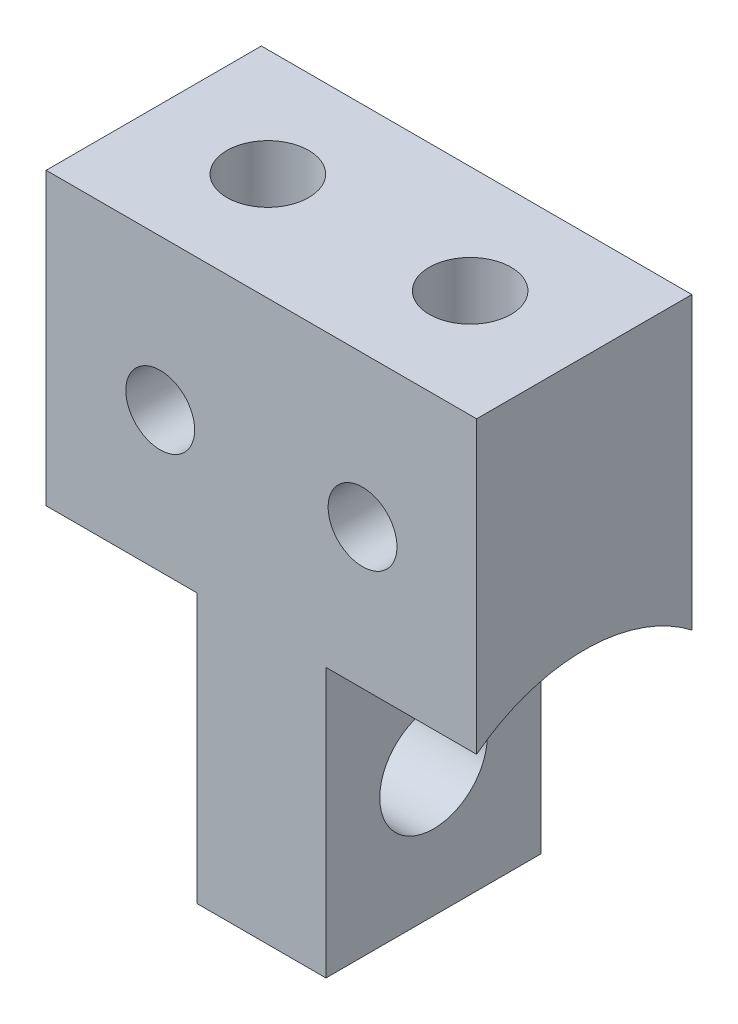
ISO-10303-21;
HEADER;
FILE_DESCRIPTION(('STEP AP214'),'2;1');
FILE_NAME('part.step','',(''),(''),'','','');
FILE_SCHEMA(('AUTOMOTIVE_DESIGN { 1 0 10303 214 1 1 1 1 }'));
ENDSEC;
DATA;
#1=APPLICATION_CONTEXT('core data for automotive mechanical design processes');
#2=APPLICATION_PROTOCOL_DEFINITION('international standard','automotive_design',2000,#1);
#3=PRODUCT_CONTEXT('',#1,'mechanical');
#4=PRODUCT('Part','Part','',(#3));
#5=PRODUCT_RELATED_PRODUCT_CATEGORY('part','',(#4));
#6=PRODUCT_DEFINITION_FORMATION('','',#4);
#7=PRODUCT_DEFINITION_CONTEXT('part definition',#1,'design');
#8=PRODUCT_DEFINITION('design','',#6,#7);
#9=PRODUCT_DEFINITION_SHAPE('','',#8);
#10=(LENGTH_UNIT() NAMED_UNIT(*) SI_UNIT(.MILLI.,.METRE.));
#11=(NAMED_UNIT(*) PLANE_ANGLE_UNIT() SI_UNIT($,.RADIAN.));
#12=(NAMED_UNIT(*) SI_UNIT($,.STERADIAN.) SOLID_ANGLE_UNIT());
#13=UNCERTAINTY_MEASURE_WITH_UNIT(LENGTH_MEASURE(1.E-05),#10,'distance_accuracy_value','');
#14=(GEOMETRIC_REPRESENTATION_CONTEXT(3) GLOBAL_UNCERTAINTY_ASSIGNED_CONTEXT((#13)) GLOBAL_UNIT_ASSIGNED_CONTEXT((#10,
#11,#12)) REPRESENTATION_CONTEXT('',''));
#15=CARTESIAN_POINT('',(0.,0.,0.));
#16=DIRECTION('',(0.,0.,1.));
#17=DIRECTION('',(1.,0.,0.));
#18=AXIS2_PLACEMENT_3D('',#15,#16,#17);
#19=CARTESIAN_POINT('',(-2.35,3.,5.));
#20=DIRECTION('',(0.,0.,-1.));
#21=DIRECTION('',(-1.,0.,0.));
#22=AXIS2_PLACEMENT_3D('',#19,#20,#21);
#23=CYLINDRICAL_SURFACE('',#22,0.8);
#24=CARTESIAN_POINT('',(-2.35,3.,5.));
#25=DIRECTION('',(0.,0.,1.));
#26=DIRECTION('',(1.,0.,0.));
#27=AXIS2_PLACEMENT_3D('',#24,#25,#26);
#28=CIRCLE('',#27,0.8);
#29=CARTESIAN_POINT('',(-1.55,3.,5.));
#30=VERTEX_POINT('',#29);
#31=EDGE_CURVE('E311',#30,#30,#28,.T.);
#32=ORIENTED_EDGE('',*,*,#31,.T.);
#33=EDGE_LOOP('',(#32));
#34=FACE_BOUND('',#33,.T.);
#35=CARTESIAN_POINT('',(-2.35,3.,0.));
#36=DIRECTION('',(0.,0.,1.));
#37=DIRECTION('',(1.,0.,0.));
#38=AXIS2_PLACEMENT_3D('',#35,#36,#37);
#39=CIRCLE('',#38,0.8);
#40=CARTESIAN_POINT('',(-1.55,3.,0.));
#41=VERTEX_POINT('',#40);
#42=EDGE_CURVE('E308',#41,#41,#39,.T.);
#43=ORIENTED_EDGE('',*,*,#42,.F.);
#44=EDGE_LOOP('',(#43));
#45=FACE_BOUND('',#44,.T.);
#46=CARTESIAN_POINT('',(-1.72550020016016,3.5,3.21589105316382));
#47=CARTESIAN_POINT('',(-1.75301055320319,3.53431435195809,3.23993184582808));
#48=CARTESIAN_POINT('',(-1.78353100918924,3.56666598593497,3.26371468114399));
#49=CARTESIAN_POINT('',(-1.85071395402182,3.62671853094582,3.30923352889173));
#50=CARTESIAN_POINT('',(-1.88742589891339,3.65437807795749,3.33095066272691));
#51=CARTESIAN_POINT('',(-1.95869479972963,3.69875943218527,3.36639071111825));
#52=CARTESIAN_POINT('',(-1.99220492473001,3.71656229625455,3.38084325634963));
#53=CARTESIAN_POINT('',(-2.06245944293185,3.74752169735336,3.40620513563468));
#54=CARTESIAN_POINT('',(-2.09919364664926,3.76069225753749,3.41712515533806));
#55=CARTESIAN_POINT('',(-2.17553630067847,3.78175562211247,3.43467004602641));
#56=CARTESIAN_POINT('',(-2.21516770677243,3.78959970272312,3.44125524814546));
#57=CARTESIAN_POINT('',(-2.29569576113832,3.79918202346721,3.44930746544825));
#58=CARTESIAN_POINT('',(-2.33659227342639,3.80092091755081,3.45077502880195));
#59=CARTESIAN_POINT('',(-2.41259358055849,3.79833165295423,3.44859555518797));
#60=CARTESIAN_POINT('',(-2.44774785061444,3.79477678136385,3.44560037974004));
#61=CARTESIAN_POINT('',(-2.5167550120299,3.78320871800817,3.43589855359897));
#62=CARTESIAN_POINT('',(-2.55060858744674,3.77519790498292,3.42919388317638));
#63=CARTESIAN_POINT('',(-2.61648948201297,3.75510255006901,3.41249541575778));
#64=CARTESIAN_POINT('',(-2.64850173058375,3.74298880799513,3.40247805506654));
#65=CARTESIAN_POINT('',(-2.7100053262118,3.71521846927709,3.37975887461044));
#66=CARTESIAN_POINT('',(-2.73949019772671,3.69955312600749,3.36705043263298));
#67=CARTESIAN_POINT('',(-2.80827303658835,3.65747385956863,3.33338875386016));
#68=CARTESIAN_POINT('',(-2.84599374919368,3.62939982473765,3.31130311992539));
#69=CARTESIAN_POINT('',(-2.91501020161723,3.56821065625755,3.26485374494461));
#70=CARTESIAN_POINT('',(-2.94634303187075,3.53512668852513,3.2405044244332));
#71=CARTESIAN_POINT('',(-2.97449979983984,3.5,3.21589105316381));
#72=B_SPLINE_CURVE_WITH_KNOTS('',3,(#46,#47,#48,#49,#50,#51,#52,#53,#54,#55,#56,#57,#58,#59,#60,
#61,#62,#63,#64,#65,#66,#67,#68,#69,#70,#71),.UNSPECIFIED.,.F.,.F.,(4,2,2,2,2,2,2,2,2,2,2,2,4),
(0.,0.150540881245239,0.302346746946312,0.423678394160233,0.544639512769526,0.666692728387725,
0.788732870015016,0.894604193645644,1.00041905356436,1.10700338996258,1.21385312209222,
1.36892840745185,1.52307587518184),.UNSPECIFIED.);
#73=CARTESIAN_POINT('',(-1.72550020016016,3.5,3.21589105316382));
#74=VERTEX_POINT('',#73);
#75=CARTESIAN_POINT('',(-2.97449979983984,3.5,3.21589105316381));
#76=VERTEX_POINT('',#75);
#77=EDGE_CURVE('E178',#74,#76,#72,.T.);
#78=ORIENTED_EDGE('',*,*,#77,.F.);
#79=DIRECTION('',(0.,0.,-1.));
#80=VECTOR('',#79,1.);
#81=CARTESIAN_POINT('',(-1.72550020016016,3.5,5.));
#82=LINE('',#81,#80);
#83=CARTESIAN_POINT('',(-1.72550020016016,3.5,1.78410894683618));
#84=VERTEX_POINT('',#83);
#85=EDGE_CURVE('E139',#74,#84,#82,.T.);
#86=ORIENTED_EDGE('',*,*,#85,.T.);
#87=CARTESIAN_POINT('',(-2.97449979983984,3.5,1.78410894683618));
#88=CARTESIAN_POINT('',(-2.9469894467968,3.53431435195809,1.76006815417192));
#89=CARTESIAN_POINT('',(-2.91646899081076,3.56666598593497,1.73628531885601));
#90=CARTESIAN_POINT('',(-2.84928604597818,3.62671853094582,1.69076647110827));
#91=CARTESIAN_POINT('',(-2.81257410108661,3.65437807795749,1.66904933727309));
#92=CARTESIAN_POINT('',(-2.74130520027036,3.69875943218528,1.63360928888175));
#93=CARTESIAN_POINT('',(-2.70779507526999,3.71656229625455,1.61915674365038));
#94=CARTESIAN_POINT('',(-2.63754055706815,3.74752169735336,1.59379486436532));
#95=CARTESIAN_POINT('',(-2.60080635335074,3.76069225753749,1.58287484466194));
#96=CARTESIAN_POINT('',(-2.52446369932153,3.78175562211247,1.56532995397359));
#97=CARTESIAN_POINT('',(-2.48483229322757,3.78959970272312,1.55874475185454));
#98=CARTESIAN_POINT('',(-2.40430423886168,3.79918202346721,1.55069253455175));
#99=CARTESIAN_POINT('',(-2.36340772657361,3.80092091755081,1.54922497119805));
#100=CARTESIAN_POINT('',(-2.28740641944151,3.79833165295423,1.55140444481203));
#101=CARTESIAN_POINT('',(-2.25225214938555,3.79477678136385,1.55439962025996));
#102=CARTESIAN_POINT('',(-2.1832449879701,3.78320871800817,1.56410144640103));
#103=CARTESIAN_POINT('',(-2.14939141255326,3.77519790498292,1.57080611682362));
#104=CARTESIAN_POINT('',(-2.08351051798702,3.75510255006901,1.58750458424222));
#105=CARTESIAN_POINT('',(-2.05149826941625,3.74298880799513,1.59752194493345));
#106=CARTESIAN_POINT('',(-1.9899946737882,3.71521846927709,1.62024112538956));
#107=CARTESIAN_POINT('',(-1.96050980227329,3.69955312600749,1.63294956736702));
#108=CARTESIAN_POINT('',(-1.89172696341165,3.65747385956863,1.66661124613983));
#109=CARTESIAN_POINT('',(-1.85400625080631,3.62939982473764,1.6886968800746));
#110=CARTESIAN_POINT('',(-1.78498979838277,3.56821065625755,1.73514625505539));
#111=CARTESIAN_POINT('',(-1.75365696812925,3.53512668852513,1.7594955755668));
#112=CARTESIAN_POINT('',(-1.72550020016016,3.5,1.78410894683618));
#113=B_SPLINE_CURVE_WITH_KNOTS('',3,(#87,#88,#89,#90,#91,#92,#93,#94,#95,#96,#97,#98,#99,#100,
#101,#102,#103,#104,#105,#106,#107,#108,#109,#110,#111,#112),.UNSPECIFIED.,.F.,.F.,(4,2,2,2,2,2,
2,2,2,2,2,2,4),(0.,0.150540881245239,0.302346746946313,0.423678394160234,0.544639512769527,
0.666692728387727,0.788732870015018,0.894604193645646,1.00041905356436,1.10700338996258,
1.21385312209222,1.36892840745185,1.52307587518184),.UNSPECIFIED.);
#114=CARTESIAN_POINT('',(-2.97449979983984,3.5,1.78410894683618));
#115=VERTEX_POINT('',#114);
#116=EDGE_CURVE('E172',#115,#84,#113,.T.);
#117=ORIENTED_EDGE('',*,*,#116,.F.);
#118=DIRECTION('',(0.,0.,-1.));
#119=VECTOR('',#118,1.);
#120=CARTESIAN_POINT('',(-2.97449979983984,3.5,5.));
#121=LINE('',#120,#119);
#122=EDGE_CURVE('E254',#115,#76,#121,.F.);
#123=ORIENTED_EDGE('',*,*,#122,.T.);
#124=EDGE_LOOP('',(#78,#86,#117,#123));
#125=FACE_BOUND('',#124,.T.);
#126=ADVANCED_FACE('F34',(#34,#45,#125),#23,.F.);
#127=CARTESIAN_POINT('',(0.,0.,5.));
#128=DIRECTION('',(0.,0.,-1.));
#129=DIRECTION('',(-1.,0.,0.));
#130=AXIS2_PLACEMENT_3D('',#127,#128,#129);
#131=PLANE('',#130);
#132=CARTESIAN_POINT('',(2.35,3.,5.));
#133=DIRECTION('',(0.,0.,1.));
#134=DIRECTION('',(-1.,0.,0.));
#135=AXIS2_PLACEMENT_3D('',#132,#133,#134);
#136=CIRCLE('',#135,0.8);
#137=CARTESIAN_POINT('',(1.55,3.,5.));
#138=VERTEX_POINT('',#137);
#139=EDGE_CURVE('E305',#138,#138,#136,.T.);
#140=ORIENTED_EDGE('',*,*,#139,.F.);
#141=EDGE_LOOP('',(#140));
#142=FACE_BOUND('',#141,.T.);
#143=ORIENTED_EDGE('',*,*,#31,.F.);
#144=EDGE_LOOP('',(#143));
#145=FACE_BOUND('',#144,.T.);
#146=DIRECTION('',(1.,0.,0.));
#147=VECTOR('',#146,1.);
#148=CARTESIAN_POINT('',(-11.5965512114594,-0.250384638145621,5.));
#149=LINE('',#148,#147);
#150=CARTESIAN_POINT('',(5.,-0.250384638145624,5.));
#151=VERTEX_POINT('',#150);
#152=CARTESIAN_POINT('',(1.5,-0.250384638145623,5.));
#153=VERTEX_POINT('',#152);
#154=EDGE_CURVE('E288',#151,#153,#149,.F.);
#155=ORIENTED_EDGE('',*,*,#154,.F.);
#156=DIRECTION('',(0.,1.,0.));
#157=VECTOR('',#156,1.);
#158=CARTESIAN_POINT('',(5.,-6.50000000000001,5.));
#159=LINE('',#158,#157);
#160=CARTESIAN_POINT('',(5.,6.49999999999999,5.));
#161=VERTEX_POINT('',#160);
#162=EDGE_CURVE('E244',#151,#161,#159,.T.);
#163=ORIENTED_EDGE('',*,*,#162,.T.);
#164=DIRECTION('',(-1.,0.,0.));
#165=VECTOR('',#164,1.);
#166=CARTESIAN_POINT('',(-5.,6.5,5.));
#167=LINE('',#166,#165);
#168=CARTESIAN_POINT('',(-5.,6.5,5.));
#169=VERTEX_POINT('',#168);
#170=EDGE_CURVE('E317',#161,#169,#167,.T.);
#171=ORIENTED_EDGE('',*,*,#170,.T.);
#172=DIRECTION('',(0.,-1.,0.));
#173=VECTOR('',#172,1.);
#174=CARTESIAN_POINT('',(-4.99999999999999,-6.50000000000001,5.));
#175=LINE('',#174,#173);
#176=CARTESIAN_POINT('',(-5.,-0.250384638145624,5.));
#177=VERTEX_POINT('',#176);
#178=EDGE_CURVE('E235',#169,#177,#175,.T.);
#179=ORIENTED_EDGE('',*,*,#178,.T.);
#180=DIRECTION('',(-1.,0.,0.));
#181=VECTOR('',#180,1.);
#182=CARTESIAN_POINT('',(11.5965512114594,-0.250384638145621,5.));
#183=LINE('',#182,#181);
#184=CARTESIAN_POINT('',(-1.5,-0.250384638145624,5.));
#185=VERTEX_POINT('',#184);
#186=EDGE_CURVE('E301',#177,#185,#183,.F.);
#187=ORIENTED_EDGE('',*,*,#186,.T.);
#188=DIRECTION('',(0.,-1.,0.));
#189=VECTOR('',#188,1.);
#190=CARTESIAN_POINT('',(-1.5,0.,5.));
#191=LINE('',#190,#189);
#192=CARTESIAN_POINT('',(-1.5,-6.50000000000001,5.));
#193=VERTEX_POINT('',#192);
#194=EDGE_CURVE('E297',#185,#193,#191,.T.);
#195=ORIENTED_EDGE('',*,*,#194,.T.);
#196=DIRECTION('',(1.,0.,0.));
#197=VECTOR('',#196,1.);
#198=CARTESIAN_POINT('',(-4.99999999999999,-6.50000000000001,5.));
#199=LINE('',#198,#197);
#200=CARTESIAN_POINT('',(1.5,-6.50000000000001,5.));
#201=VERTEX_POINT('',#200);
#202=EDGE_CURVE('E236',#193,#201,#199,.T.);
#203=ORIENTED_EDGE('',*,*,#202,.T.);
#204=DIRECTION('',(0.,-1.,0.));
#205=VECTOR('',#204,1.);
#206=CARTESIAN_POINT('',(1.5,0.,5.));
#207=LINE('',#206,#205);
#208=EDGE_CURVE('E283',#153,#201,#207,.T.);
#209=ORIENTED_EDGE('',*,*,#208,.F.);
#210=EDGE_LOOP('',(#155,#163,#171,#179,#187,#195,#203,#209));
#211=FACE_BOUND('',#210,.T.);
#212=ADVANCED_FACE('F185',(#142,#145,#211),#131,.F.);
#213=CARTESIAN_POINT('',(0.,0.,0.));
#214=DIRECTION('',(0.,0.,-1.));
#215=DIRECTION('',(-1.,0.,0.));
#216=AXIS2_PLACEMENT_3D('',#213,#214,#215);
#217=PLANE('',#216);
#218=ORIENTED_EDGE('',*,*,#42,.T.);
#219=EDGE_LOOP('',(#218));
#220=FACE_BOUND('',#219,.T.);
#221=CARTESIAN_POINT('',(2.35,3.,0.));
#222=DIRECTION('',(0.,0.,1.));
#223=DIRECTION('',(-1.,0.,0.));
#224=AXIS2_PLACEMENT_3D('',#221,#222,#223);
#225=CIRCLE('',#224,0.8);
#226=CARTESIAN_POINT('',(1.55,3.,0.));
#227=VERTEX_POINT('',#226);
#228=EDGE_CURVE('E304',#227,#227,#225,.T.);
#229=ORIENTED_EDGE('',*,*,#228,.T.);
#230=EDGE_LOOP('',(#229));
#231=FACE_BOUND('',#230,.T.);
#232=DIRECTION('',(0.,1.,0.));
#233=VECTOR('',#232,1.);
#234=CARTESIAN_POINT('',(5.,-6.50000000000001,0.));
#235=LINE('',#234,#233);
#236=CARTESIAN_POINT('',(5.,-0.250384638145624,0.));
#237=VERTEX_POINT('',#236);
#238=CARTESIAN_POINT('',(5.,6.49999999999999,0.));
#239=VERTEX_POINT('',#238);
#240=EDGE_CURVE('E230',#237,#239,#235,.T.);
#241=ORIENTED_EDGE('',*,*,#240,.F.);
#242=DIRECTION('',(1.,0.,0.));
#243=VECTOR('',#242,1.);
#244=CARTESIAN_POINT('',(-11.5965512114594,-0.250384638145621,0.));
#245=LINE('',#244,#243);
#246=CARTESIAN_POINT('',(1.5,-0.250384638145623,0.));
#247=VERTEX_POINT('',#246);
#248=EDGE_CURVE('E285',#237,#247,#245,.F.);
#249=ORIENTED_EDGE('',*,*,#248,.T.);
#250=DIRECTION('',(0.,-1.,0.));
#251=VECTOR('',#250,1.);
#252=CARTESIAN_POINT('',(1.5,0.,0.));
#253=LINE('',#252,#251);
#254=CARTESIAN_POINT('',(1.5,-6.50000000000001,0.));
#255=VERTEX_POINT('',#254);
#256=EDGE_CURVE('E278',#247,#255,#253,.T.);
#257=ORIENTED_EDGE('',*,*,#256,.T.);
#258=DIRECTION('',(1.,0.,0.));
#259=VECTOR('',#258,1.);
#260=CARTESIAN_POINT('',(-4.99999999999999,-6.50000000000001,0.));
#261=LINE('',#260,#259);
#262=CARTESIAN_POINT('',(-1.5,-6.50000000000001,0.));
#263=VERTEX_POINT('',#262);
#264=EDGE_CURVE('E241',#263,#255,#261,.T.);
#265=ORIENTED_EDGE('',*,*,#264,.F.);
#266=DIRECTION('',(0.,-1.,0.));
#267=VECTOR('',#266,1.);
#268=CARTESIAN_POINT('',(-1.5,0.,0.));
#269=LINE('',#268,#267);
#270=CARTESIAN_POINT('',(-1.5,-0.250384638145624,0.));
#271=VERTEX_POINT('',#270);
#272=EDGE_CURVE('E295',#271,#263,#269,.T.);
#273=ORIENTED_EDGE('',*,*,#272,.F.);
#274=DIRECTION('',(-1.,0.,0.));
#275=VECTOR('',#274,1.);
#276=CARTESIAN_POINT('',(11.5965512114594,-0.250384638145621,0.));
#277=LINE('',#276,#275);
#278=CARTESIAN_POINT('',(-5.,-0.250384638145624,0.));
#279=VERTEX_POINT('',#278);
#280=EDGE_CURVE('E240',#279,#271,#277,.F.);
#281=ORIENTED_EDGE('',*,*,#280,.F.);
#282=DIRECTION('',(0.,-1.,0.));
#283=VECTOR('',#282,1.);
#284=CARTESIAN_POINT('',(-4.99999999999999,-6.50000000000001,0.));
#285=LINE('',#284,#283);
#286=CARTESIAN_POINT('',(-5.,6.5,0.));
#287=VERTEX_POINT('',#286);
#288=EDGE_CURVE('E229',#287,#279,#285,.T.);
#289=ORIENTED_EDGE('',*,*,#288,.F.);
#290=DIRECTION('',(-1.,0.,0.));
#291=VECTOR('',#290,1.);
#292=CARTESIAN_POINT('',(-5.,6.5,0.));
#293=LINE('',#292,#291);
#294=EDGE_CURVE('E219',#239,#287,#293,.T.);
#295=ORIENTED_EDGE('',*,*,#294,.F.);
#296=EDGE_LOOP('',(#241,#249,#257,#265,#273,#281,#289,#295));
#297=FACE_BOUND('',#296,.T.);
#298=ADVANCED_FACE('F190',(#220,#231,#297),#217,.T.);
#299=CARTESIAN_POINT('',(-4.99999999999999,-6.50000000000001,5.));
#300=DIRECTION('',(0.,1.,0.));
#301=DIRECTION('',(-1.,0.,0.));
#302=AXIS2_PLACEMENT_3D('',#299,#300,#301);
#303=PLANE('',#302);
#304=DIRECTION('',(0.,0.,-1.));
#305=VECTOR('',#304,1.);
#306=CARTESIAN_POINT('',(1.5,-6.50000000000001,5.));
#307=LINE('',#306,#305);
#308=EDGE_CURVE('E252',#201,#255,#307,.T.);
#309=ORIENTED_EDGE('',*,*,#308,.F.);
#310=ORIENTED_EDGE('',*,*,#202,.F.);
#311=DIRECTION('',(0.,0.,-1.));
#312=VECTOR('',#311,1.);
#313=CARTESIAN_POINT('',(-1.5,-6.50000000000001,5.));
#314=LINE('',#313,#312);
#315=EDGE_CURVE('E249',#193,#263,#314,.T.);
#316=ORIENTED_EDGE('',*,*,#315,.T.);
#317=ORIENTED_EDGE('',*,*,#264,.T.);
#318=EDGE_LOOP('',(#309,#310,#316,#317));
#319=FACE_BOUND('',#318,.T.);
#320=ADVANCED_FACE('F194',(#319),#303,.F.);
#321=CARTESIAN_POINT('',(5.,-6.50000000000001,5.));
#322=DIRECTION('',(-1.,0.,0.));
#323=DIRECTION('',(0.,-1.,0.));
#324=AXIS2_PLACEMENT_3D('',#321,#322,#323);
#325=PLANE('',#324);
#326=CARTESIAN_POINT('',(4.99999999999999,-3.50000000000001,2.5));
#327=DIRECTION('',(-1.,0.,0.));
#328=DIRECTION('',(0.,-1.,0.));
#329=AXIS2_PLACEMENT_3D('',#326,#327,#328);
#330=CIRCLE('',#329,4.1);
#331=EDGE_CURVE('E257',#151,#237,#330,.T.);
#332=ORIENTED_EDGE('',*,*,#331,.T.);
#333=ORIENTED_EDGE('',*,*,#240,.T.);
#334=DIRECTION('',(0.,0.,-1.));
#335=VECTOR('',#334,1.);
#336=CARTESIAN_POINT('',(5.,6.49999999999999,5.));
#337=LINE('',#336,#335);
#338=EDGE_CURVE('E225',#161,#239,#337,.T.);
#339=ORIENTED_EDGE('',*,*,#338,.F.);
#340=ORIENTED_EDGE('',*,*,#162,.F.);
#341=EDGE_LOOP('',(#332,#333,#339,#340));
#342=FACE_BOUND('',#341,.T.);
#343=ADVANCED_FACE('F36',(#342),#325,.F.);
#344=CARTESIAN_POINT('',(-5.,6.5,5.));
#345=DIRECTION('',(0.,-1.,0.));
#346=DIRECTION('',(1.,0.,0.));
#347=AXIS2_PLACEMENT_3D('',#344,#345,#346);
#348=PLANE('',#347);
#349=CARTESIAN_POINT('',(2.35,6.49999999999999,2.5));
#350=DIRECTION('',(0.,1.,0.));
#351=DIRECTION('',(1.,0.,0.));
#352=AXIS2_PLACEMENT_3D('',#349,#350,#351);
#353=CIRCLE('',#352,0.95);
#354=CARTESIAN_POINT('',(3.3,6.49999999999999,2.5));
#355=VERTEX_POINT('',#354);
#356=EDGE_CURVE('E212',#355,#355,#353,.T.);
#357=ORIENTED_EDGE('',*,*,#356,.F.);
#358=EDGE_LOOP('',(#357));
#359=FACE_BOUND('',#358,.T.);
#360=CARTESIAN_POINT('',(-2.35,6.5,2.5));
#361=DIRECTION('',(0.,1.,0.));
#362=DIRECTION('',(-1.,0.,0.));
#363=AXIS2_PLACEMENT_3D('',#360,#361,#362);
#364=CIRCLE('',#363,0.95);
#365=CARTESIAN_POINT('',(-3.3,6.5,2.5));
#366=VERTEX_POINT('',#365);
#367=EDGE_CURVE('E133',#366,#366,#364,.T.);
#368=ORIENTED_EDGE('',*,*,#367,.F.);
#369=EDGE_LOOP('',(#368));
#370=FACE_BOUND('',#369,.T.);
#371=ORIENTED_EDGE('',*,*,#294,.T.);
#372=DIRECTION('',(0.,0.,-1.));
#373=VECTOR('',#372,1.);
#374=CARTESIAN_POINT('',(-5.,6.5,5.));
#375=LINE('',#374,#373);
#376=EDGE_CURVE('E222',#169,#287,#375,.T.);
#377=ORIENTED_EDGE('',*,*,#376,.F.);
#378=ORIENTED_EDGE('',*,*,#170,.F.);
#379=ORIENTED_EDGE('',*,*,#338,.T.);
#380=EDGE_LOOP('',(#371,#377,#378,#379));
#381=FACE_BOUND('',#380,.T.);
#382=ADVANCED_FACE('F201',(#359,#370,#381),#348,.F.);
#383=CARTESIAN_POINT('',(-4.99999999999999,-6.50000000000001,5.));
#384=DIRECTION('',(1.,0.,0.));
#385=DIRECTION('',(0.,1.,0.));
#386=AXIS2_PLACEMENT_3D('',#383,#384,#385);
#387=PLANE('',#386);
#388=ORIENTED_EDGE('',*,*,#288,.T.);
#389=CARTESIAN_POINT('',(-4.99999999999999,-3.50000000000001,2.5));
#390=DIRECTION('',(-1.,0.,0.));
#391=DIRECTION('',(0.,-1.,0.));
#392=AXIS2_PLACEMENT_3D('',#389,#390,#391);
#393=CIRCLE('',#392,4.1);
#394=EDGE_CURVE('E290',#177,#279,#393,.T.);
#395=ORIENTED_EDGE('',*,*,#394,.F.);
#396=ORIENTED_EDGE('',*,*,#178,.F.);
#397=ORIENTED_EDGE('',*,*,#376,.T.);
#398=EDGE_LOOP('',(#388,#395,#396,#397));
#399=FACE_BOUND('',#398,.T.);
#400=ADVANCED_FACE('F199',(#399),#387,.F.);
#401=CARTESIAN_POINT('',(2.35,3.,5.));
#402=DIRECTION('',(0.,0.,-1.));
#403=DIRECTION('',(-1.,0.,0.));
#404=AXIS2_PLACEMENT_3D('',#401,#402,#403);
#405=CYLINDRICAL_SURFACE('',#404,0.8);
#406=DIRECTION('',(0.,0.,-1.));
#407=VECTOR('',#406,1.);
#408=CARTESIAN_POINT('',(1.72550020016016,3.49999999999999,5.));
#409=LINE('',#408,#407);
#410=CARTESIAN_POINT('',(1.72550020016016,3.49999999999999,3.21589105316381));
#411=VERTEX_POINT('',#410);
#412=CARTESIAN_POINT('',(1.72550020016016,3.49999999999999,1.78410894683619));
#413=VERTEX_POINT('',#412);
#414=EDGE_CURVE('E12',#411,#413,#409,.T.);
#415=ORIENTED_EDGE('',*,*,#414,.F.);
#416=CARTESIAN_POINT('',(2.97449979983985,3.49999999999999,3.21589105316381));
#417=CARTESIAN_POINT('',(2.94698944679681,3.53431435195809,3.23993184582808));
#418=CARTESIAN_POINT('',(2.91646899081077,3.56666598593496,3.26371468114398));
#419=CARTESIAN_POINT('',(2.84928604597819,3.62671853094581,3.30923352889173));
#420=CARTESIAN_POINT('',(2.81257410108661,3.65437807795749,3.33095066272691));
#421=CARTESIAN_POINT('',(2.74130520027037,3.69875943218527,3.36639071111825));
#422=CARTESIAN_POINT('',(2.70779507527,3.71656229625455,3.38084325634962));
#423=CARTESIAN_POINT('',(2.63754055706816,3.74752169735336,3.40620513563468));
#424=CARTESIAN_POINT('',(2.60080635335075,3.76069225753749,3.41712515533806));
#425=CARTESIAN_POINT('',(2.52446369932153,3.78175562211247,3.43467004602641));
#426=CARTESIAN_POINT('',(2.48483229322757,3.78959970272312,3.44125524814546));
#427=CARTESIAN_POINT('',(2.40430423886169,3.79918202346721,3.44930746544825));
#428=CARTESIAN_POINT('',(2.36340772657362,3.80092091755081,3.45077502880195));
#429=CARTESIAN_POINT('',(2.28740641944151,3.79833165295423,3.44859555518797));
#430=CARTESIAN_POINT('',(2.25225214938556,3.79477678136385,3.44560037974004));
#431=CARTESIAN_POINT('',(2.1832449879701,3.78320871800817,3.43589855359897));
#432=CARTESIAN_POINT('',(2.14939141255326,3.77519790498292,3.42919388317638));
#433=CARTESIAN_POINT('',(2.08351051798703,3.75510255006901,3.41249541575778));
#434=CARTESIAN_POINT('',(2.05149826941626,3.74298880799513,3.40247805506655));
#435=CARTESIAN_POINT('',(1.98999467378821,3.71521846927709,3.37975887461044));
#436=CARTESIAN_POINT('',(1.96050980227329,3.69955312600749,3.36705043263298));
#437=CARTESIAN_POINT('',(1.89172696341165,3.65747385956863,3.33338875386017));
#438=CARTESIAN_POINT('',(1.85400625080632,3.62939982473765,3.3113031199254));
#439=CARTESIAN_POINT('',(1.78498979838277,3.56821065625755,3.26485374494461));
#440=CARTESIAN_POINT('',(1.75365696812925,3.53512668852512,3.2405044244332));
#441=CARTESIAN_POINT('',(1.72550020016016,3.49999999999999,3.21589105316381));
#442=B_SPLINE_CURVE_WITH_KNOTS('',3,(#416,#417,#418,#419,#420,#421,#422,#423,#424,#425,#426,
#427,#428,#429,#430,#431,#432,#433,#434,#435,#436,#437,#438,#439,#440,#441),.UNSPECIFIED.,.F.,
.F.,(4,2,2,2,2,2,2,2,2,2,2,2,4),(0.,0.150540881245239,0.302346746946313,0.423678394160234,
0.544639512769527,0.666692728387728,0.788732870015019,0.894604193645648,1.00041905356436,
1.10700338996258,1.21385312209222,1.36892840745186,1.52307587518185),.UNSPECIFIED.);
#443=CARTESIAN_POINT('',(2.97449979983985,3.49999999999999,3.21589105316381));
#444=VERTEX_POINT('',#443);
#445=EDGE_CURVE('E42',#444,#411,#442,.T.);
#446=ORIENTED_EDGE('',*,*,#445,.F.);
#447=DIRECTION('',(0.,0.,-1.));
#448=VECTOR('',#447,1.);
#449=CARTESIAN_POINT('',(2.97449979983985,3.49999999999999,5.));
#450=LINE('',#449,#448);
#451=CARTESIAN_POINT('',(2.97449979983985,3.49999999999999,1.78410894683619));
#452=VERTEX_POINT('',#451);
#453=EDGE_CURVE('E137',#452,#444,#450,.F.);
#454=ORIENTED_EDGE('',*,*,#453,.F.);
#455=CARTESIAN_POINT('',(1.72550020016016,3.49999999999999,1.78410894683619));
#456=CARTESIAN_POINT('',(1.75301055320319,3.53431435195809,1.76006815417192));
#457=CARTESIAN_POINT('',(1.78353100918923,3.56666598593497,1.73628531885602));
#458=CARTESIAN_POINT('',(1.85071395402182,3.62671853094582,1.69076647110827));
#459=CARTESIAN_POINT('',(1.88742589891339,3.65437807795749,1.66904933727309));
#460=CARTESIAN_POINT('',(1.95869479972963,3.69875943218527,1.63360928888176));
#461=CARTESIAN_POINT('',(1.99220492473001,3.71656229625455,1.61915674365038));
#462=CARTESIAN_POINT('',(2.06245944293185,3.74752169735336,1.59379486436532));
#463=CARTESIAN_POINT('',(2.09919364664926,3.76069225753749,1.58287484466194));
#464=CARTESIAN_POINT('',(2.17553630067847,3.78175562211247,1.5653299539736));
#465=CARTESIAN_POINT('',(2.21516770677243,3.78959970272312,1.55874475185454));
#466=CARTESIAN_POINT('',(2.29569576113832,3.79918202346721,1.55069253455175));
#467=CARTESIAN_POINT('',(2.33659227342639,3.80092091755081,1.54922497119805));
#468=CARTESIAN_POINT('',(2.41259358055849,3.79833165295423,1.55140444481203));
#469=CARTESIAN_POINT('',(2.44774785061444,3.79477678136385,1.55439962025996));
#470=CARTESIAN_POINT('',(2.5167550120299,3.78320871800817,1.56410144640103));
#471=CARTESIAN_POINT('',(2.55060858744674,3.77519790498292,1.57080611682362));
#472=CARTESIAN_POINT('',(2.61648948201297,3.75510255006901,1.58750458424222));
#473=CARTESIAN_POINT('',(2.64850173058375,3.74298880799513,1.59752194493346));
#474=CARTESIAN_POINT('',(2.7100053262118,3.71521846927709,1.62024112538956));
#475=CARTESIAN_POINT('',(2.73949019772671,3.69955312600749,1.63294956736702));
#476=CARTESIAN_POINT('',(2.80827303658835,3.65747385956863,1.66661124613983));
#477=CARTESIAN_POINT('',(2.84599374919369,3.62939982473764,1.68869688007461));
#478=CARTESIAN_POINT('',(2.91501020161724,3.56821065625755,1.73514625505539));
#479=CARTESIAN_POINT('',(2.94634303187075,3.53512668852512,1.75949557556681));
#480=CARTESIAN_POINT('',(2.97449979983985,3.49999999999999,1.78410894683619));
#481=B_SPLINE_CURVE_WITH_KNOTS('',3,(#455,#456,#457,#458,#459,#460,#461,#462,#463,#464,#465,
#466,#467,#468,#469,#470,#471,#472,#473,#474,#475,#476,#477,#478,#479,#480),.UNSPECIFIED.,.F.,
.F.,(4,2,2,2,2,2,2,2,2,2,2,2,4),(0.,0.15054088124524,0.302346746946313,0.423678394160235,
0.544639512769528,0.666692728387728,0.78873287001502,0.894604193645648,1.00041905356436,
1.10700338996258,1.21385312209222,1.36892840745186,1.52307587518185),.UNSPECIFIED.);
#482=EDGE_CURVE('E131',#413,#452,#481,.T.);
#483=ORIENTED_EDGE('',*,*,#482,.F.);
#484=EDGE_LOOP('',(#415,#446,#454,#483));
#485=FACE_BOUND('',#484,.T.);
#486=ORIENTED_EDGE('',*,*,#139,.T.);
#487=EDGE_LOOP('',(#486));
#488=FACE_BOUND('',#487,.T.);
#489=ORIENTED_EDGE('',*,*,#228,.F.);
#490=EDGE_LOOP('',(#489));
#491=FACE_BOUND('',#490,.T.);
#492=ADVANCED_FACE('F135',(#485,#488,#491),#405,.F.);
#493=CARTESIAN_POINT('',(11.5965512114594,-3.5,2.5));
#494=DIRECTION('',(-1.,0.,0.));
#495=DIRECTION('',(0.,-1.,0.));
#496=AXIS2_PLACEMENT_3D('',#493,#494,#495);
#497=CYLINDRICAL_SURFACE('',#496,4.1);
#498=ORIENTED_EDGE('',*,*,#394,.T.);
#499=ORIENTED_EDGE('',*,*,#280,.T.);
#500=CARTESIAN_POINT('',(-1.5,-3.50000000000001,2.5));
#501=DIRECTION('',(1.,0.,0.));
#502=DIRECTION('',(0.,0.,-1.));
#503=AXIS2_PLACEMENT_3D('',#500,#501,#502);
#504=CIRCLE('',#503,4.1);
#505=EDGE_CURVE('E292',#185,#271,#504,.F.);
#506=ORIENTED_EDGE('',*,*,#505,.F.);
#507=ORIENTED_EDGE('',*,*,#186,.F.);
#508=EDGE_LOOP('',(#498,#499,#506,#507));
#509=FACE_BOUND('',#508,.T.);
#510=ADVANCED_FACE('F337',(#509),#497,.F.);
#511=CARTESIAN_POINT('',(-1.5,0.,0.));
#512=DIRECTION('',(1.,0.,0.));
#513=DIRECTION('',(0.,0.,-1.));
#514=AXIS2_PLACEMENT_3D('',#511,#512,#513);
#515=PLANE('',#514);
#516=CARTESIAN_POINT('',(-1.5,-3.50000000000001,2.5));
#517=DIRECTION('',(-1.,0.,0.));
#518=DIRECTION('',(0.,0.,1.));
#519=AXIS2_PLACEMENT_3D('',#516,#517,#518);
#520=CIRCLE('',#519,1.25);
#521=CARTESIAN_POINT('',(-1.5,-3.50000000000001,3.75));
#522=VERTEX_POINT('',#521);
#523=EDGE_CURVE('E258',#522,#522,#520,.T.);
#524=ORIENTED_EDGE('',*,*,#523,.F.);
#525=EDGE_LOOP('',(#524));
#526=FACE_BOUND('',#525,.T.);
#527=ORIENTED_EDGE('',*,*,#505,.T.);
#528=ORIENTED_EDGE('',*,*,#272,.T.);
#529=ORIENTED_EDGE('',*,*,#315,.F.);
#530=ORIENTED_EDGE('',*,*,#194,.F.);
#531=EDGE_LOOP('',(#527,#528,#529,#530));
#532=FACE_BOUND('',#531,.T.);
#533=ADVANCED_FACE('F334',(#526,#532),#515,.F.);
#534=CARTESIAN_POINT('',(-11.5965512114594,-3.5,2.5));
#535=DIRECTION('',(1.,0.,0.));
#536=DIRECTION('',(0.,1.,0.));
#537=AXIS2_PLACEMENT_3D('',#534,#535,#536);
#538=CYLINDRICAL_SURFACE('',#537,4.1);
#539=ORIENTED_EDGE('',*,*,#154,.T.);
#540=CARTESIAN_POINT('',(1.5,-3.50000000000001,2.5));
#541=DIRECTION('',(1.,0.,0.));
#542=DIRECTION('',(0.,0.,-1.));
#543=AXIS2_PLACEMENT_3D('',#540,#541,#542);
#544=CIRCLE('',#543,4.1);
#545=EDGE_CURVE('E275',#247,#153,#544,.T.);
#546=ORIENTED_EDGE('',*,*,#545,.F.);
#547=ORIENTED_EDGE('',*,*,#248,.F.);
#548=ORIENTED_EDGE('',*,*,#331,.F.);
#549=EDGE_LOOP('',(#539,#546,#547,#548));
#550=FACE_BOUND('',#549,.T.);
#551=ADVANCED_FACE('F325',(#550),#538,.F.);
#552=CARTESIAN_POINT('',(1.5,0.,0.));
#553=DIRECTION('',(1.,0.,0.));
#554=DIRECTION('',(0.,0.,-1.));
#555=AXIS2_PLACEMENT_3D('',#552,#553,#554);
#556=PLANE('',#555);
#557=CARTESIAN_POINT('',(1.5,-3.50000000000001,2.5));
#558=DIRECTION('',(1.,0.,0.));
#559=DIRECTION('',(0.,0.,-1.));
#560=AXIS2_PLACEMENT_3D('',#557,#558,#559);
#561=CIRCLE('',#560,1.25);
#562=CARTESIAN_POINT('',(1.5,-3.50000000000001,1.25));
#563=VERTEX_POINT('',#562);
#564=EDGE_CURVE('E255',#563,#563,#561,.T.);
#565=ORIENTED_EDGE('',*,*,#564,.F.);
#566=EDGE_LOOP('',(#565));
#567=FACE_BOUND('',#566,.T.);
#568=ORIENTED_EDGE('',*,*,#208,.T.);
#569=ORIENTED_EDGE('',*,*,#308,.T.);
#570=ORIENTED_EDGE('',*,*,#256,.F.);
#571=ORIENTED_EDGE('',*,*,#545,.T.);
#572=EDGE_LOOP('',(#568,#569,#570,#571));
#573=FACE_BOUND('',#572,.T.);
#574=ADVANCED_FACE('F329',(#567,#573),#556,.T.);
#575=CARTESIAN_POINT('',(5.,-3.50000000000001,2.5));
#576=DIRECTION('',(-1.,0.,0.));
#577=DIRECTION('',(0.,0.,1.));
#578=AXIS2_PLACEMENT_3D('',#575,#576,#577);
#579=CYLINDRICAL_SURFACE('',#578,1.25);
#580=ORIENTED_EDGE('',*,*,#564,.T.);
#581=EDGE_LOOP('',(#580));
#582=FACE_BOUND('',#581,.T.);
#583=ORIENTED_EDGE('',*,*,#523,.T.);
#584=EDGE_LOOP('',(#583));
#585=FACE_BOUND('',#584,.T.);
#586=ADVANCED_FACE('F168',(#582,#585),#579,.F.);
#587=CARTESIAN_POINT('',(-2.35,3.5,2.5));
#588=DIRECTION('',(0.,1.,0.));
#589=DIRECTION('',(-1.,0.,0.));
#590=AXIS2_PLACEMENT_3D('',#587,#588,#589);
#591=PLANE('',#590);
#592=CARTESIAN_POINT('',(-2.35,3.5,2.5));
#593=DIRECTION('',(0.,1.,0.));
#594=DIRECTION('',(-1.,0.,0.));
#595=AXIS2_PLACEMENT_3D('',#592,#593,#594);
#596=CIRCLE('',#595,0.95);
#597=EDGE_CURVE('E266',#74,#84,#596,.T.);
#598=ORIENTED_EDGE('',*,*,#597,.T.);
#599=ORIENTED_EDGE('',*,*,#85,.F.);
#600=EDGE_LOOP('',(#598,#599));
#601=FACE_BOUND('',#600,.T.);
#602=ADVANCED_FACE('F163',(#601),#591,.T.);
#603=CARTESIAN_POINT('',(-2.35,3.5,2.5));
#604=DIRECTION('',(0.,1.,0.));
#605=DIRECTION('',(-1.,0.,0.));
#606=AXIS2_PLACEMENT_3D('',#603,#604,#605);
#607=CYLINDRICAL_SURFACE('',#606,0.95);
#608=ORIENTED_EDGE('',*,*,#77,.T.);
#609=EDGE_CURVE('E55',#115,#76,#596,.T.);
#610=ORIENTED_EDGE('',*,*,#609,.F.);
#611=ORIENTED_EDGE('',*,*,#116,.T.);
#612=ORIENTED_EDGE('',*,*,#597,.F.);
#613=EDGE_LOOP('',(#608,#610,#611,#612));
#614=FACE_BOUND('',#613,.T.);
#615=ORIENTED_EDGE('',*,*,#367,.T.);
#616=EDGE_LOOP('',(#615));
#617=FACE_BOUND('',#616,.T.);
#618=ADVANCED_FACE('F162',(#614,#617),#607,.F.);
#619=ORIENTED_EDGE('',*,*,#609,.T.);
#620=ORIENTED_EDGE('',*,*,#122,.F.);
#621=EDGE_LOOP('',(#619,#620));
#622=FACE_BOUND('',#621,.T.);
#623=ADVANCED_FACE('F158',(#622),#591,.T.);
#624=CARTESIAN_POINT('',(2.35,3.49999999999999,2.5));
#625=DIRECTION('',(0.,-1.,0.));
#626=DIRECTION('',(1.,0.,0.));
#627=AXIS2_PLACEMENT_3D('',#624,#625,#626);
#628=PLANE('',#627);
#629=ORIENTED_EDGE('',*,*,#414,.T.);
#630=CARTESIAN_POINT('',(2.35,3.49999999999999,2.5));
#631=DIRECTION('',(0.,1.,0.));
#632=DIRECTION('',(1.,0.,0.));
#633=AXIS2_PLACEMENT_3D('',#630,#631,#632);
#634=CIRCLE('',#633,0.95);
#635=EDGE_CURVE('E124',#413,#411,#634,.T.);
#636=ORIENTED_EDGE('',*,*,#635,.T.);
#637=EDGE_LOOP('',(#629,#636));
#638=FACE_BOUND('',#637,.T.);
#639=ADVANCED_FACE('F123',(#638),#628,.F.);
#640=CARTESIAN_POINT('',(2.35,3.49999999999999,2.5));
#641=DIRECTION('',(0.,1.,0.));
#642=DIRECTION('',(-1.,0.,0.));
#643=AXIS2_PLACEMENT_3D('',#640,#641,#642);
#644=CYLINDRICAL_SURFACE('',#643,0.95);
#645=ORIENTED_EDGE('',*,*,#445,.T.);
#646=ORIENTED_EDGE('',*,*,#635,.F.);
#647=ORIENTED_EDGE('',*,*,#482,.T.);
#648=EDGE_CURVE('E48',#444,#452,#634,.T.);
#649=ORIENTED_EDGE('',*,*,#648,.F.);
#650=EDGE_LOOP('',(#645,#646,#647,#649));
#651=FACE_BOUND('',#650,.T.);
#652=ORIENTED_EDGE('',*,*,#356,.T.);
#653=EDGE_LOOP('',(#652));
#654=FACE_BOUND('',#653,.T.);
#655=ADVANCED_FACE('F129',(#651,#654),#644,.F.);
#656=ORIENTED_EDGE('',*,*,#453,.T.);
#657=ORIENTED_EDGE('',*,*,#648,.T.);
#658=EDGE_LOOP('',(#656,#657));
#659=FACE_BOUND('',#658,.T.);
#660=ADVANCED_FACE('F157',(#659),#628,.F.);
#661=CLOSED_SHELL('',(#126,#212,#298,#320,#343,#382,#400,#492,#510,#533,#551,#574,#586,#602,
#618,#623,#639,#655,#660));
#662=MANIFOLD_SOLID_BREP('B2',#661);
#663=ADVANCED_BREP_SHAPE_REPRESENTATION('',(#18,#662),#14);
#664=SHAPE_DEFINITION_REPRESENTATION(#9,#663);
ENDSEC;
END-ISO-10303-21;
